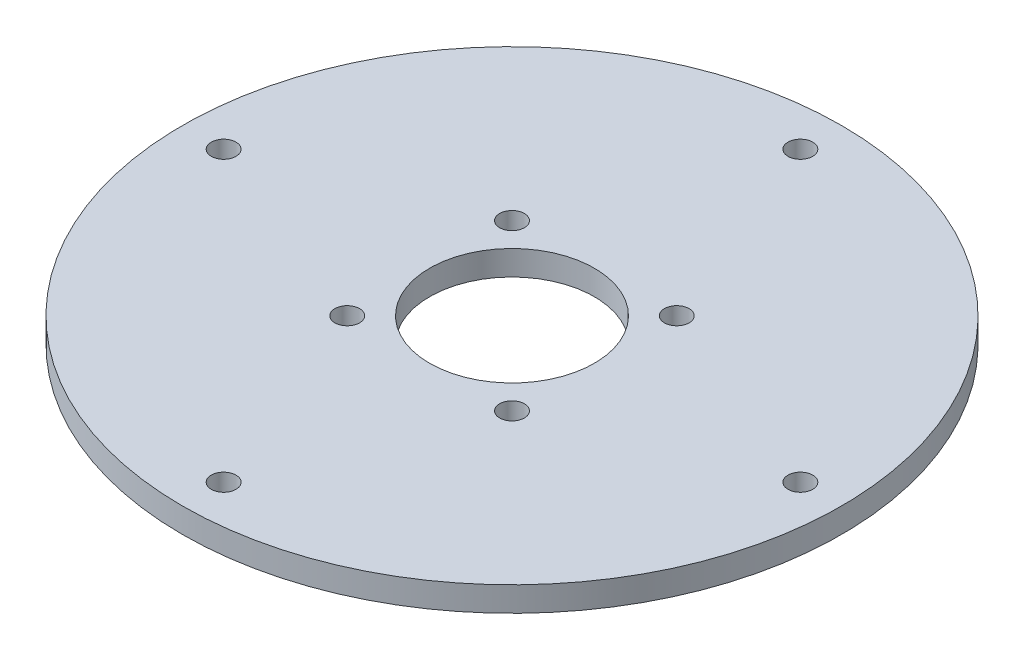
ISO-10303-21;
HEADER;
FILE_DESCRIPTION(('STEP AP214'),'2;1');
FILE_NAME('part.step','',(''),(''),'','','');
FILE_SCHEMA(('AUTOMOTIVE_DESIGN { 1 0 10303 214 1 1 1 1 }'));
ENDSEC;
DATA;
#1=APPLICATION_CONTEXT('core data for automotive mechanical design processes');
#2=APPLICATION_PROTOCOL_DEFINITION('international standard','automotive_design',2000,#1);
#3=PRODUCT_CONTEXT('',#1,'mechanical');
#4=PRODUCT('Part','Part','',(#3));
#5=PRODUCT_RELATED_PRODUCT_CATEGORY('part','',(#4));
#6=PRODUCT_DEFINITION_FORMATION('','',#4);
#7=PRODUCT_DEFINITION_CONTEXT('part definition',#1,'design');
#8=PRODUCT_DEFINITION('design','',#6,#7);
#9=PRODUCT_DEFINITION_SHAPE('','',#8);
#10=(LENGTH_UNIT() NAMED_UNIT(*) SI_UNIT(.MILLI.,.METRE.));
#11=(NAMED_UNIT(*) PLANE_ANGLE_UNIT() SI_UNIT($,.RADIAN.));
#12=(NAMED_UNIT(*) SI_UNIT($,.STERADIAN.) SOLID_ANGLE_UNIT());
#13=UNCERTAINTY_MEASURE_WITH_UNIT(LENGTH_MEASURE(1.E-05),#10,'distance_accuracy_value','');
#14=(GEOMETRIC_REPRESENTATION_CONTEXT(3) GLOBAL_UNCERTAINTY_ASSIGNED_CONTEXT((#13)) GLOBAL_UNIT_ASSIGNED_CONTEXT((#10,
#11,#12)) REPRESENTATION_CONTEXT('',''));
#15=CARTESIAN_POINT('',(0.,0.,0.));
#16=DIRECTION('',(0.,0.,1.));
#17=DIRECTION('',(1.,0.,0.));
#18=AXIS2_PLACEMENT_3D('',#15,#16,#17);
#19=CARTESIAN_POINT('',(0.,3.,0.));
#20=DIRECTION('',(0.,1.,0.));
#21=DIRECTION('',(0.,0.,1.));
#22=AXIS2_PLACEMENT_3D('',#19,#20,#21);
#23=PLANE('',#22);
#24=CARTESIAN_POINT('',(0.,3.,0.));
#25=DIRECTION('',(0.,1.,0.));
#26=DIRECTION('',(0.,0.,1.));
#27=AXIS2_PLACEMENT_3D('',#24,#25,#26);
#28=CIRCLE('',#27,10.);
#29=CARTESIAN_POINT('',(0.,3.,10.));
#30=VERTEX_POINT('',#29);
#31=EDGE_CURVE('E92',#30,#30,#28,.T.);
#32=ORIENTED_EDGE('',*,*,#31,.F.);
#33=EDGE_LOOP('',(#32));
#34=FACE_BOUND('',#33,.T.);
#35=CARTESIAN_POINT('',(10.,3.,10.));
#36=DIRECTION('',(0.,1.,0.));
#37=DIRECTION('',(0.,0.,1.));
#38=AXIS2_PLACEMENT_3D('',#35,#36,#37);
#39=CIRCLE('',#38,1.5);
#40=CARTESIAN_POINT('',(10.,3.,11.5));
#41=VERTEX_POINT('',#40);
#42=EDGE_CURVE('E75',#41,#41,#39,.T.);
#43=ORIENTED_EDGE('',*,*,#42,.F.);
#44=EDGE_LOOP('',(#43));
#45=FACE_BOUND('',#44,.T.);
#46=CARTESIAN_POINT('',(-10.,3.,10.));
#47=DIRECTION('',(0.,1.,0.));
#48=DIRECTION('',(0.,0.,1.));
#49=AXIS2_PLACEMENT_3D('',#46,#47,#48);
#50=CIRCLE('',#49,1.5);
#51=CARTESIAN_POINT('',(-10.,3.,11.5));
#52=VERTEX_POINT('',#51);
#53=EDGE_CURVE('E81',#52,#52,#50,.T.);
#54=ORIENTED_EDGE('',*,*,#53,.F.);
#55=EDGE_LOOP('',(#54));
#56=FACE_BOUND('',#55,.T.);
#57=CARTESIAN_POINT('',(-10.,3.,-10.));
#58=DIRECTION('',(0.,1.,0.));
#59=DIRECTION('',(0.,0.,1.));
#60=AXIS2_PLACEMENT_3D('',#57,#58,#59);
#61=CIRCLE('',#60,1.5);
#62=CARTESIAN_POINT('',(-10.,3.,-8.5));
#63=VERTEX_POINT('',#62);
#64=EDGE_CURVE('E87',#63,#63,#61,.T.);
#65=ORIENTED_EDGE('',*,*,#64,.F.);
#66=EDGE_LOOP('',(#65));
#67=FACE_BOUND('',#66,.T.);
#68=CARTESIAN_POINT('',(10.,3.,-10.));
#69=DIRECTION('',(0.,1.,0.));
#70=DIRECTION('',(0.,0.,1.));
#71=AXIS2_PLACEMENT_3D('',#68,#69,#70);
#72=CIRCLE('',#71,1.5);
#73=CARTESIAN_POINT('',(10.,3.,-8.5));
#74=VERTEX_POINT('',#73);
#75=EDGE_CURVE('E69',#74,#74,#72,.T.);
#76=ORIENTED_EDGE('',*,*,#75,.F.);
#77=EDGE_LOOP('',(#76));
#78=FACE_BOUND('',#77,.T.);
#79=CARTESIAN_POINT('',(0.,3.,35.));
#80=DIRECTION('',(0.,1.,0.));
#81=DIRECTION('',(0.,0.,1.));
#82=AXIS2_PLACEMENT_3D('',#79,#80,#81);
#83=CIRCLE('',#82,1.5);
#84=CARTESIAN_POINT('',(0.,3.,36.5));
#85=VERTEX_POINT('',#84);
#86=EDGE_CURVE('E54',#85,#85,#83,.T.);
#87=ORIENTED_EDGE('',*,*,#86,.F.);
#88=EDGE_LOOP('',(#87));
#89=FACE_BOUND('',#88,.T.);
#90=CARTESIAN_POINT('',(0.,3.,-35.));
#91=DIRECTION('',(0.,1.,0.));
#92=DIRECTION('',(0.,0.,1.));
#93=AXIS2_PLACEMENT_3D('',#90,#91,#92);
#94=CIRCLE('',#93,1.5);
#95=CARTESIAN_POINT('',(0.,3.,-33.5));
#96=VERTEX_POINT('',#95);
#97=EDGE_CURVE('E43',#96,#96,#94,.T.);
#98=ORIENTED_EDGE('',*,*,#97,.F.);
#99=EDGE_LOOP('',(#98));
#100=FACE_BOUND('',#99,.T.);
#101=CARTESIAN_POINT('',(0.,3.,0.));
#102=DIRECTION('',(0.,1.,0.));
#103=DIRECTION('',(0.,0.,1.));
#104=AXIS2_PLACEMENT_3D('',#101,#102,#103);
#105=CIRCLE('',#104,40.);
#106=CARTESIAN_POINT('',(0.,3.,40.));
#107=VERTEX_POINT('',#106);
#108=EDGE_CURVE('E10',#107,#107,#105,.T.);
#109=ORIENTED_EDGE('',*,*,#108,.T.);
#110=EDGE_LOOP('',(#109));
#111=FACE_BOUND('',#110,.T.);
#112=CARTESIAN_POINT('',(35.,3.,0.));
#113=DIRECTION('',(0.,1.,0.));
#114=DIRECTION('',(0.,0.,1.));
#115=AXIS2_PLACEMENT_3D('',#112,#113,#114);
#116=CIRCLE('',#115,1.5);
#117=CARTESIAN_POINT('',(35.,3.,1.5));
#118=VERTEX_POINT('',#117);
#119=EDGE_CURVE('E48',#118,#118,#116,.T.);
#120=ORIENTED_EDGE('',*,*,#119,.F.);
#121=EDGE_LOOP('',(#120));
#122=FACE_BOUND('',#121,.T.);
#123=CARTESIAN_POINT('',(-35.,3.,0.));
#124=DIRECTION('',(0.,1.,0.));
#125=DIRECTION('',(0.,0.,1.));
#126=AXIS2_PLACEMENT_3D('',#123,#124,#125);
#127=CIRCLE('',#126,1.5);
#128=CARTESIAN_POINT('',(-35.,3.,1.5));
#129=VERTEX_POINT('',#128);
#130=EDGE_CURVE('E60',#129,#129,#127,.T.);
#131=ORIENTED_EDGE('',*,*,#130,.F.);
#132=EDGE_LOOP('',(#131));
#133=FACE_BOUND('',#132,.T.);
#134=ADVANCED_FACE('F30',(#34,#45,#56,#67,#78,#89,#100,#111,#122,#133),#23,.T.);
#135=CARTESIAN_POINT('',(0.,0.,0.));
#136=DIRECTION('',(0.,1.,0.));
#137=DIRECTION('',(0.,0.,1.));
#138=AXIS2_PLACEMENT_3D('',#135,#136,#137);
#139=PLANE('',#138);
#140=CARTESIAN_POINT('',(0.,0.,0.));
#141=DIRECTION('',(0.,1.,0.));
#142=DIRECTION('',(0.,0.,1.));
#143=AXIS2_PLACEMENT_3D('',#140,#141,#142);
#144=CIRCLE('',#143,10.);
#145=CARTESIAN_POINT('',(0.,0.,10.));
#146=VERTEX_POINT('',#145);
#147=EDGE_CURVE('E34',#146,#146,#144,.T.);
#148=ORIENTED_EDGE('',*,*,#147,.T.);
#149=EDGE_LOOP('',(#148));
#150=FACE_BOUND('',#149,.T.);
#151=CARTESIAN_POINT('',(10.,0.,10.));
#152=DIRECTION('',(0.,1.,0.));
#153=DIRECTION('',(0.,0.,1.));
#154=AXIS2_PLACEMENT_3D('',#151,#152,#153);
#155=CIRCLE('',#154,1.5);
#156=CARTESIAN_POINT('',(10.,0.,11.5));
#157=VERTEX_POINT('',#156);
#158=EDGE_CURVE('E78',#157,#157,#155,.T.);
#159=ORIENTED_EDGE('',*,*,#158,.T.);
#160=EDGE_LOOP('',(#159));
#161=FACE_BOUND('',#160,.T.);
#162=CARTESIAN_POINT('',(-10.,0.,10.));
#163=DIRECTION('',(0.,1.,0.));
#164=DIRECTION('',(0.,0.,1.));
#165=AXIS2_PLACEMENT_3D('',#162,#163,#164);
#166=CIRCLE('',#165,1.5);
#167=CARTESIAN_POINT('',(-10.,0.,11.5));
#168=VERTEX_POINT('',#167);
#169=EDGE_CURVE('E84',#168,#168,#166,.T.);
#170=ORIENTED_EDGE('',*,*,#169,.T.);
#171=EDGE_LOOP('',(#170));
#172=FACE_BOUND('',#171,.T.);
#173=CARTESIAN_POINT('',(-10.,0.,-10.));
#174=DIRECTION('',(0.,1.,0.));
#175=DIRECTION('',(0.,0.,1.));
#176=AXIS2_PLACEMENT_3D('',#173,#174,#175);
#177=CIRCLE('',#176,1.5);
#178=CARTESIAN_POINT('',(-10.,0.,-8.5));
#179=VERTEX_POINT('',#178);
#180=EDGE_CURVE('E72',#179,#179,#177,.T.);
#181=ORIENTED_EDGE('',*,*,#180,.T.);
#182=EDGE_LOOP('',(#181));
#183=FACE_BOUND('',#182,.T.);
#184=CARTESIAN_POINT('',(10.,0.,-10.));
#185=DIRECTION('',(0.,1.,0.));
#186=DIRECTION('',(0.,0.,1.));
#187=AXIS2_PLACEMENT_3D('',#184,#185,#186);
#188=CIRCLE('',#187,1.5);
#189=CARTESIAN_POINT('',(10.,0.,-8.5));
#190=VERTEX_POINT('',#189);
#191=EDGE_CURVE('E66',#190,#190,#188,.T.);
#192=ORIENTED_EDGE('',*,*,#191,.T.);
#193=EDGE_LOOP('',(#192));
#194=FACE_BOUND('',#193,.T.);
#195=CARTESIAN_POINT('',(0.,0.,0.));
#196=DIRECTION('',(0.,1.,0.));
#197=DIRECTION('',(0.,0.,1.));
#198=AXIS2_PLACEMENT_3D('',#195,#196,#197);
#199=CIRCLE('',#198,40.);
#200=CARTESIAN_POINT('',(0.,0.,40.));
#201=VERTEX_POINT('',#200);
#202=EDGE_CURVE('E38',#201,#201,#199,.T.);
#203=ORIENTED_EDGE('',*,*,#202,.F.);
#204=EDGE_LOOP('',(#203));
#205=FACE_BOUND('',#204,.T.);
#206=CARTESIAN_POINT('',(0.,0.,-35.));
#207=DIRECTION('',(0.,1.,0.));
#208=DIRECTION('',(0.,0.,1.));
#209=AXIS2_PLACEMENT_3D('',#206,#207,#208);
#210=CIRCLE('',#209,1.5);
#211=CARTESIAN_POINT('',(0.,0.,-33.5));
#212=VERTEX_POINT('',#211);
#213=EDGE_CURVE('E45',#212,#212,#210,.T.);
#214=ORIENTED_EDGE('',*,*,#213,.T.);
#215=EDGE_LOOP('',(#214));
#216=FACE_BOUND('',#215,.T.);
#217=CARTESIAN_POINT('',(35.,0.,0.));
#218=DIRECTION('',(0.,1.,0.));
#219=DIRECTION('',(0.,0.,1.));
#220=AXIS2_PLACEMENT_3D('',#217,#218,#219);
#221=CIRCLE('',#220,1.5);
#222=CARTESIAN_POINT('',(35.,0.,1.5));
#223=VERTEX_POINT('',#222);
#224=EDGE_CURVE('E51',#223,#223,#221,.T.);
#225=ORIENTED_EDGE('',*,*,#224,.T.);
#226=EDGE_LOOP('',(#225));
#227=FACE_BOUND('',#226,.T.);
#228=CARTESIAN_POINT('',(0.,0.,35.));
#229=DIRECTION('',(0.,1.,0.));
#230=DIRECTION('',(0.,0.,1.));
#231=AXIS2_PLACEMENT_3D('',#228,#229,#230);
#232=CIRCLE('',#231,1.5);
#233=CARTESIAN_POINT('',(0.,0.,36.5));
#234=VERTEX_POINT('',#233);
#235=EDGE_CURVE('E57',#234,#234,#232,.T.);
#236=ORIENTED_EDGE('',*,*,#235,.T.);
#237=EDGE_LOOP('',(#236));
#238=FACE_BOUND('',#237,.T.);
#239=CARTESIAN_POINT('',(-35.,0.,0.));
#240=DIRECTION('',(0.,1.,0.));
#241=DIRECTION('',(0.,0.,1.));
#242=AXIS2_PLACEMENT_3D('',#239,#240,#241);
#243=CIRCLE('',#242,1.5);
#244=CARTESIAN_POINT('',(-35.,0.,1.5));
#245=VERTEX_POINT('',#244);
#246=EDGE_CURVE('E63',#245,#245,#243,.T.);
#247=ORIENTED_EDGE('',*,*,#246,.T.);
#248=EDGE_LOOP('',(#247));
#249=FACE_BOUND('',#248,.T.);
#250=ADVANCED_FACE('F99',(#150,#161,#172,#183,#194,#205,#216,#227,#238,#249),#139,.F.);
#251=CARTESIAN_POINT('',(0.,3.,0.));
#252=DIRECTION('',(0.,-1.,0.));
#253=DIRECTION('',(0.,0.,-1.));
#254=AXIS2_PLACEMENT_3D('',#251,#252,#253);
#255=CYLINDRICAL_SURFACE('',#254,40.);
#256=ORIENTED_EDGE('',*,*,#108,.F.);
#257=EDGE_LOOP('',(#256));
#258=FACE_BOUND('',#257,.T.);
#259=ORIENTED_EDGE('',*,*,#202,.T.);
#260=EDGE_LOOP('',(#259));
#261=FACE_BOUND('',#260,.T.);
#262=ADVANCED_FACE('F32',(#258,#261),#255,.T.);
#263=CARTESIAN_POINT('',(0.,3.,-35.));
#264=DIRECTION('',(0.,-1.,0.));
#265=DIRECTION('',(0.,0.,-1.));
#266=AXIS2_PLACEMENT_3D('',#263,#264,#265);
#267=CYLINDRICAL_SURFACE('',#266,1.5);
#268=ORIENTED_EDGE('',*,*,#97,.T.);
#269=EDGE_LOOP('',(#268));
#270=FACE_BOUND('',#269,.T.);
#271=ORIENTED_EDGE('',*,*,#213,.F.);
#272=EDGE_LOOP('',(#271));
#273=FACE_BOUND('',#272,.T.);
#274=ADVANCED_FACE('F121',(#270,#273),#267,.F.);
#275=CARTESIAN_POINT('',(35.,3.,0.));
#276=DIRECTION('',(0.,-1.,0.));
#277=DIRECTION('',(0.,0.,-1.));
#278=AXIS2_PLACEMENT_3D('',#275,#276,#277);
#279=CYLINDRICAL_SURFACE('',#278,1.5);
#280=ORIENTED_EDGE('',*,*,#119,.T.);
#281=EDGE_LOOP('',(#280));
#282=FACE_BOUND('',#281,.T.);
#283=ORIENTED_EDGE('',*,*,#224,.F.);
#284=EDGE_LOOP('',(#283));
#285=FACE_BOUND('',#284,.T.);
#286=ADVANCED_FACE('F124',(#282,#285),#279,.F.);
#287=CARTESIAN_POINT('',(0.,3.,35.));
#288=DIRECTION('',(0.,-1.,0.));
#289=DIRECTION('',(0.,0.,-1.));
#290=AXIS2_PLACEMENT_3D('',#287,#288,#289);
#291=CYLINDRICAL_SURFACE('',#290,1.5);
#292=ORIENTED_EDGE('',*,*,#86,.T.);
#293=EDGE_LOOP('',(#292));
#294=FACE_BOUND('',#293,.T.);
#295=ORIENTED_EDGE('',*,*,#235,.F.);
#296=EDGE_LOOP('',(#295));
#297=FACE_BOUND('',#296,.T.);
#298=ADVANCED_FACE('F128',(#294,#297),#291,.F.);
#299=CARTESIAN_POINT('',(-35.,3.,0.));
#300=DIRECTION('',(0.,-1.,0.));
#301=DIRECTION('',(0.,0.,-1.));
#302=AXIS2_PLACEMENT_3D('',#299,#300,#301);
#303=CYLINDRICAL_SURFACE('',#302,1.5);
#304=ORIENTED_EDGE('',*,*,#130,.T.);
#305=EDGE_LOOP('',(#304));
#306=FACE_BOUND('',#305,.T.);
#307=ORIENTED_EDGE('',*,*,#246,.F.);
#308=EDGE_LOOP('',(#307));
#309=FACE_BOUND('',#308,.T.);
#310=ADVANCED_FACE('F132',(#306,#309),#303,.F.);
#311=CARTESIAN_POINT('',(10.,0.,-10.));
#312=DIRECTION('',(0.,1.,0.));
#313=DIRECTION('',(0.,0.,1.));
#314=AXIS2_PLACEMENT_3D('',#311,#312,#313);
#315=CYLINDRICAL_SURFACE('',#314,1.5);
#316=ORIENTED_EDGE('',*,*,#191,.F.);
#317=EDGE_LOOP('',(#316));
#318=FACE_BOUND('',#317,.T.);
#319=ORIENTED_EDGE('',*,*,#75,.T.);
#320=EDGE_LOOP('',(#319));
#321=FACE_BOUND('',#320,.T.);
#322=ADVANCED_FACE('F136',(#318,#321),#315,.F.);
#323=CARTESIAN_POINT('',(-10.,0.,-10.));
#324=DIRECTION('',(0.,1.,0.));
#325=DIRECTION('',(0.,0.,1.));
#326=AXIS2_PLACEMENT_3D('',#323,#324,#325);
#327=CYLINDRICAL_SURFACE('',#326,1.5);
#328=ORIENTED_EDGE('',*,*,#180,.F.);
#329=EDGE_LOOP('',(#328));
#330=FACE_BOUND('',#329,.T.);
#331=ORIENTED_EDGE('',*,*,#64,.T.);
#332=EDGE_LOOP('',(#331));
#333=FACE_BOUND('',#332,.T.);
#334=ADVANCED_FACE('F139',(#330,#333),#327,.F.);
#335=CARTESIAN_POINT('',(-10.,0.,10.));
#336=DIRECTION('',(0.,1.,0.));
#337=DIRECTION('',(0.,0.,1.));
#338=AXIS2_PLACEMENT_3D('',#335,#336,#337);
#339=CYLINDRICAL_SURFACE('',#338,1.5);
#340=ORIENTED_EDGE('',*,*,#169,.F.);
#341=EDGE_LOOP('',(#340));
#342=FACE_BOUND('',#341,.T.);
#343=ORIENTED_EDGE('',*,*,#53,.T.);
#344=EDGE_LOOP('',(#343));
#345=FACE_BOUND('',#344,.T.);
#346=ADVANCED_FACE('F109',(#342,#345),#339,.F.);
#347=CARTESIAN_POINT('',(10.,0.,10.));
#348=DIRECTION('',(0.,1.,0.));
#349=DIRECTION('',(0.,0.,1.));
#350=AXIS2_PLACEMENT_3D('',#347,#348,#349);
#351=CYLINDRICAL_SURFACE('',#350,1.5);
#352=ORIENTED_EDGE('',*,*,#158,.F.);
#353=EDGE_LOOP('',(#352));
#354=FACE_BOUND('',#353,.T.);
#355=ORIENTED_EDGE('',*,*,#42,.T.);
#356=EDGE_LOOP('',(#355));
#357=FACE_BOUND('',#356,.T.);
#358=ADVANCED_FACE('F104',(#354,#357),#351,.F.);
#359=CARTESIAN_POINT('',(0.,-7.,0.));
#360=DIRECTION('',(0.,1.,0.));
#361=DIRECTION('',(0.,0.,1.));
#362=AXIS2_PLACEMENT_3D('',#359,#360,#361);
#363=CYLINDRICAL_SURFACE('',#362,10.);
#364=ORIENTED_EDGE('',*,*,#31,.T.);
#365=EDGE_LOOP('',(#364));
#366=FACE_BOUND('',#365,.T.);
#367=ORIENTED_EDGE('',*,*,#147,.F.);
#368=EDGE_LOOP('',(#367));
#369=FACE_BOUND('',#368,.T.);
#370=ADVANCED_FACE('F102',(#366,#369),#363,.F.);
#371=CLOSED_SHELL('',(#134,#250,#262,#274,#286,#298,#310,#322,#334,#346,#358,#370));
#372=MANIFOLD_SOLID_BREP('B2',#371);
#373=ADVANCED_BREP_SHAPE_REPRESENTATION('',(#18,#372),#14);
#374=SHAPE_DEFINITION_REPRESENTATION(#9,#373);
ENDSEC;
END-ISO-10303-21;
